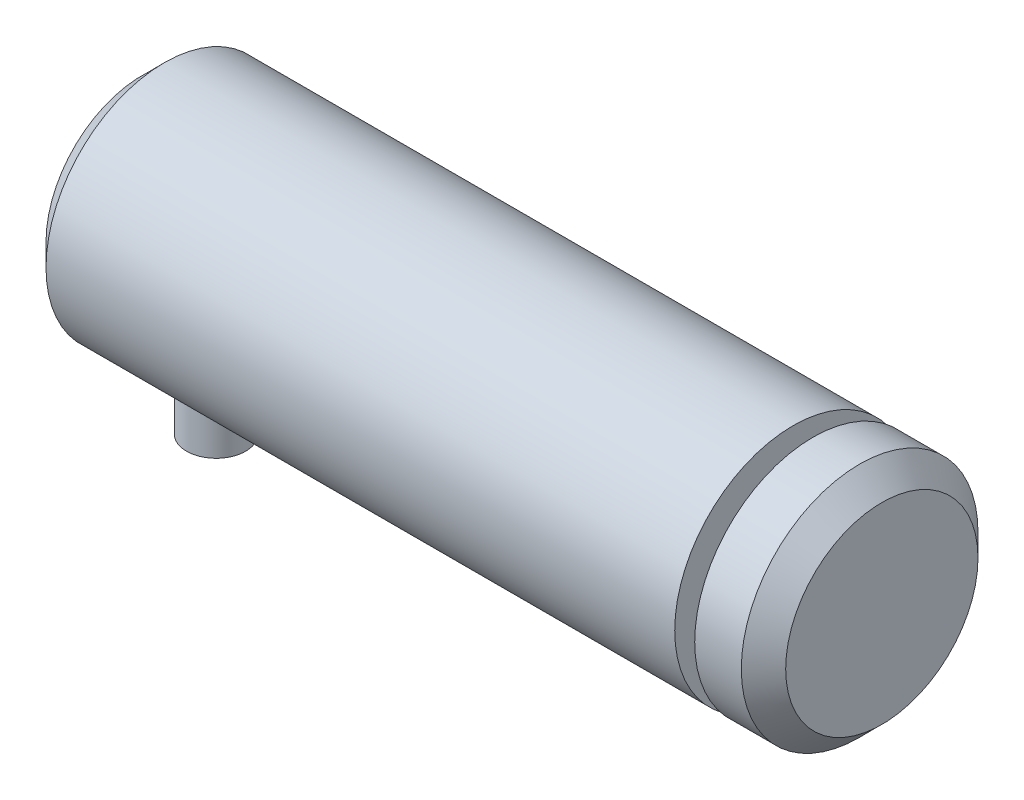
ISO-10303-21;
HEADER;
FILE_DESCRIPTION(('STEP AP214'),'2;1');
FILE_NAME('part.step','',(''),(''),'','','');
FILE_SCHEMA(('AUTOMOTIVE_DESIGN { 1 0 10303 214 1 1 1 1 }'));
ENDSEC;
DATA;
#1=APPLICATION_CONTEXT('core data for automotive mechanical design processes');
#2=APPLICATION_PROTOCOL_DEFINITION('international standard','automotive_design',2000,#1);
#3=PRODUCT_CONTEXT('',#1,'mechanical');
#4=PRODUCT('Part','Part','',(#3));
#5=PRODUCT_RELATED_PRODUCT_CATEGORY('part','',(#4));
#6=PRODUCT_DEFINITION_FORMATION('','',#4);
#7=PRODUCT_DEFINITION_CONTEXT('part definition',#1,'design');
#8=PRODUCT_DEFINITION('design','',#6,#7);
#9=PRODUCT_DEFINITION_SHAPE('','',#8);
#10=(LENGTH_UNIT() NAMED_UNIT(*) SI_UNIT(.MILLI.,.METRE.));
#11=(NAMED_UNIT(*) PLANE_ANGLE_UNIT() SI_UNIT($,.RADIAN.));
#12=(NAMED_UNIT(*) SI_UNIT($,.STERADIAN.) SOLID_ANGLE_UNIT());
#13=UNCERTAINTY_MEASURE_WITH_UNIT(LENGTH_MEASURE(1.E-05),#10,'distance_accuracy_value','');
#14=(GEOMETRIC_REPRESENTATION_CONTEXT(3) GLOBAL_UNCERTAINTY_ASSIGNED_CONTEXT((#13)) GLOBAL_UNIT_ASSIGNED_CONTEXT((#10,
#11,#12)) REPRESENTATION_CONTEXT('',''));
#15=CARTESIAN_POINT('',(0.,0.,0.));
#16=DIRECTION('',(0.,0.,1.));
#17=DIRECTION('',(1.,0.,0.));
#18=AXIS2_PLACEMENT_3D('',#15,#16,#17);
#19=CARTESIAN_POINT('',(19.,0.,0.));
#20=DIRECTION('',(-1.,0.,0.));
#21=DIRECTION('',(0.,0.,1.));
#22=AXIS2_PLACEMENT_3D('',#19,#20,#21);
#23=CYLINDRICAL_SURFACE('',#22,8.);
#24=CARTESIAN_POINT('',(20.35,0.,0.));
#25=DIRECTION('',(-1.,0.,0.));
#26=DIRECTION('',(0.,0.,1.));
#27=AXIS2_PLACEMENT_3D('',#24,#25,#26);
#28=CIRCLE('',#27,8.);
#29=CARTESIAN_POINT('',(20.35,0.,8.));
#30=VERTEX_POINT('',#29);
#31=EDGE_CURVE('E58',#30,#30,#28,.T.);
#32=ORIENTED_EDGE('',*,*,#31,.F.);
#33=EDGE_LOOP('',(#32));
#34=FACE_BOUND('',#33,.T.);
#35=CARTESIAN_POINT('',(23.5,0.,0.));
#36=DIRECTION('',(-1.,0.,0.));
#37=DIRECTION('',(0.,0.,1.));
#38=AXIS2_PLACEMENT_3D('',#35,#36,#37);
#39=CIRCLE('',#38,8.);
#40=CARTESIAN_POINT('',(23.5,0.,8.));
#41=VERTEX_POINT('',#40);
#42=EDGE_CURVE('E67',#41,#41,#39,.T.);
#43=ORIENTED_EDGE('',*,*,#42,.T.);
#44=EDGE_LOOP('',(#43));
#45=FACE_BOUND('',#44,.T.);
#46=ADVANCED_FACE('F31',(#34,#45),#23,.T.);
#47=CARTESIAN_POINT('',(-23.5,0.,0.));
#48=DIRECTION('',(-1.,0.,0.));
#49=DIRECTION('',(0.,0.,1.));
#50=AXIS2_PLACEMENT_3D('',#47,#48,#49);
#51=CIRCLE('',#50,8.);
#52=CARTESIAN_POINT('',(-23.5,0.,8.));
#53=VERTEX_POINT('',#52);
#54=EDGE_CURVE('E10',#53,#53,#51,.T.);
#55=ORIENTED_EDGE('',*,*,#54,.F.);
#56=EDGE_LOOP('',(#55));
#57=FACE_BOUND('',#56,.T.);
#58=CARTESIAN_POINT('',(-20.,-7.74596669241483,2.));
#59=CARTESIAN_POINT('',(-19.8895593992587,-7.74596880070288,1.99999686287446));
#60=CARTESIAN_POINT('',(-19.7790840810572,-7.74835444811678,1.99082099639812));
#61=CARTESIAN_POINT('',(-19.5613059374612,-7.75761489594051,1.95441850037103));
#62=CARTESIAN_POINT('',(-19.4540049964255,-7.76449230897304,1.92718136539368));
#63=CARTESIAN_POINT('',(-19.2457571694503,-7.7819097967692,1.85559295970563));
#64=CARTESIAN_POINT('',(-19.1448022756914,-7.79244514152366,1.81126378228359));
#65=CARTESIAN_POINT('',(-18.9517513179681,-7.81598553623007,1.7068169130091));
#66=CARTESIAN_POINT('',(-18.8596556303358,-7.82899069102791,1.64669855084854));
#67=CARTESIAN_POINT('',(-18.6849106837902,-7.856325730845,1.5109667418495));
#68=CARTESIAN_POINT('',(-18.60248511972,-7.87067678098427,1.43506951016324));
#69=CARTESIAN_POINT('',(-18.4513908845117,-7.89890300412235,1.27054565128053));
#70=CARTESIAN_POINT('',(-18.3827234995026,-7.91277813253111,1.18191783534424));
#71=CARTESIAN_POINT('',(-18.260179625895,-7.93872332416466,0.992916160863162));
#72=CARTESIAN_POINT('',(-18.2065228894708,-7.95076549920474,0.892395660956094));
#73=CARTESIAN_POINT('',(-18.1169522846775,-7.97144649540787,0.683410547434207));
#74=CARTESIAN_POINT('',(-18.0810357984676,-7.98008581867475,0.574947108633549));
#75=CARTESIAN_POINT('',(-18.0286817323371,-7.99283807078544,0.355487007003325));
#76=CARTESIAN_POINT('',(-18.0118642845387,-7.99703915075451,0.244586175639176));
#77=CARTESIAN_POINT('',(-17.9969932965796,-8.00074875285838,0.0214630554102116));
#78=CARTESIAN_POINT('',(-17.9989369822323,-8.00025796877363,-0.0907590356304586));
#79=CARTESIAN_POINT('',(-18.0212598802001,-7.99470475962828,-0.310704494344778));
#80=CARTESIAN_POINT('',(-18.0412290600431,-7.98974401872699,-0.418472431202137));
#81=CARTESIAN_POINT('',(-18.0983770160388,-7.97592669219883,-0.629076494827375));
#82=CARTESIAN_POINT('',(-18.1355567083019,-7.96706989918753,-0.731912358740878));
#83=CARTESIAN_POINT('',(-18.2264020565497,-7.94630007760717,-0.930813407003615));
#84=CARTESIAN_POINT('',(-18.2802136357294,-7.93436015756043,-1.02680901953301));
#85=CARTESIAN_POINT('',(-18.402684543293,-7.90871923047719,-1.20855124468098));
#86=CARTESIAN_POINT('',(-18.4713464548485,-7.89501791721992,-1.29429607017101));
#87=CARTESIAN_POINT('',(-18.6237669935859,-7.86690971015616,-1.45554807016991));
#88=CARTESIAN_POINT('',(-18.7078839138782,-7.85249375620734,-1.5307153581504));
#89=CARTESIAN_POINT('',(-18.8876799788322,-7.82492034813365,-1.66595275192604));
#90=CARTESIAN_POINT('',(-18.9833596635928,-7.81176295284776,-1.72602215209203));
#91=CARTESIAN_POINT('',(-19.1842320273192,-7.78816397465319,-1.8295762580452));
#92=CARTESIAN_POINT('',(-19.2894685842506,-7.77773586980577,-1.87297913394098));
#93=CARTESIAN_POINT('',(-19.5060683744612,-7.76094912111966,-1.94137124127268));
#94=CARTESIAN_POINT('',(-19.6174302911865,-7.75458960648175,-1.96636441310582));
#95=CARTESIAN_POINT('',(-19.8399676012185,-7.74684284831313,-1.99666371093214));
#96=CARTESIAN_POINT('',(-19.9510702346637,-7.74532871274919,-2.0024723791357));
#97=CARTESIAN_POINT('',(-20.1726575492625,-7.74709874784831,-1.99561359241244));
#98=CARTESIAN_POINT('',(-20.283142286361,-7.75038247681013,-1.98294783827904));
#99=CARTESIAN_POINT('',(-20.4984914119638,-7.76125665563648,-1.93994037115013));
#100=CARTESIAN_POINT('',(-20.6034181812567,-7.768775761875,-1.90989125462539));
#101=CARTESIAN_POINT('',(-20.8067451662813,-7.7872057461677,-1.83329446533649));
#102=CARTESIAN_POINT('',(-20.9051446072443,-7.79811702598891,-1.78674483817003));
#103=CARTESIAN_POINT('',(-21.0947530222939,-7.8223690967461,-1.67741653434924));
#104=CARTESIAN_POINT('',(-21.1857830720345,-7.83575334885313,-1.6143374030685));
#105=CARTESIAN_POINT('',(-21.3561506902411,-7.86333666457373,-1.47412058586891));
#106=CARTESIAN_POINT('',(-21.4354863333201,-7.87753586182776,-1.39698058961088));
#107=CARTESIAN_POINT('',(-21.5822488340568,-7.90557922425285,-1.22852544196945));
#108=CARTESIAN_POINT('',(-21.649328050039,-7.91940561649468,-1.13690390506318));
#109=CARTESIAN_POINT('',(-21.767148693561,-7.94477773290988,-0.943405365389347));
#110=CARTESIAN_POINT('',(-21.8178909732866,-7.95632357603169,-0.841528897915179));
#111=CARTESIAN_POINT('',(-21.9011568276223,-7.9757609259065,-0.631116403462178));
#112=CARTESIAN_POINT('',(-21.9338114275033,-7.98367864017925,-0.522634762055761));
#113=CARTESIAN_POINT('',(-21.9803682676867,-7.99508234716634,-0.301499520637611));
#114=CARTESIAN_POINT('',(-21.9942741269912,-7.99856919514738,-0.188846730082478));
#115=CARTESIAN_POINT('',(-22.0027351791511,-8.00068338817612,0.0341670528866493));
#116=CARTESIAN_POINT('',(-21.9978034181908,-7.99943957759977,0.144507653932046));
#117=CARTESIAN_POINT('',(-21.9699043454113,-7.99251792914887,0.362734992829504));
#118=CARTESIAN_POINT('',(-21.9469375699737,-7.98684022314338,0.47062180356186));
#119=CARTESIAN_POINT('',(-21.8838955604583,-7.97170865707778,0.68034207128955));
#120=CARTESIAN_POINT('',(-21.8439130933712,-7.96227529004785,0.782204989161727));
#121=CARTESIAN_POINT('',(-21.7480588419609,-7.94062577827316,0.977834106083249));
#122=CARTESIAN_POINT('',(-21.692185054659,-7.92840928277515,1.07159928253127));
#123=CARTESIAN_POINT('',(-21.5645695320077,-7.90214499360574,1.25080385684661));
#124=CARTESIAN_POINT('',(-21.4924797141923,-7.88806033883329,1.33598997659667));
#125=CARTESIAN_POINT('',(-21.3351542960453,-7.85981298114379,1.49323004054701));
#126=CARTESIAN_POINT('',(-21.2499153677777,-7.84565025934604,1.56528065015318));
#127=CARTESIAN_POINT('',(-21.0667971716211,-7.81854951691005,1.69552405294366));
#128=CARTESIAN_POINT('',(-20.9687117532695,-7.80563927346578,1.75343323883276));
#129=CARTESIAN_POINT('',(-20.7638890202504,-7.78287910989656,1.85185379317094));
#130=CARTESIAN_POINT('',(-20.6571580678123,-7.77302696466428,1.8923778195043));
#131=CARTESIAN_POINT('',(-20.4588459763297,-7.75903817501475,1.948845057142));
#132=CARTESIAN_POINT('',(-20.3682136712277,-7.75417326006998,1.96798634119376));
#133=CARTESIAN_POINT('',(-20.1850622620046,-7.7476367716524,1.99356458514354));
#134=CARTESIAN_POINT('',(-20.0925433195112,-7.74596492578215,2.0000026287435));
#135=CARTESIAN_POINT('',(-20.,-7.74596669241483,2.));
#136=B_SPLINE_CURVE_WITH_KNOTS('',3,(#58,#59,#60,#61,#62,#63,#64,#65,#66,#67,#68,#69,#70,#71,
#72,#73,#74,#75,#76,#77,#78,#79,#80,#81,#82,#83,#84,#85,#86,#87,#88,#89,#90,#91,#92,#93,#94,#95,
#96,#97,#98,#99,#100,#101,#102,#103,#104,#105,#106,#107,#108,#109,#110,#111,#112,#113,#114,#115,
#116,#117,#118,#119,#120,#121,#122,#123,#124,#125,#126,#127,#128,#129,#130,#131,#132,#133,#134,
#135),.UNSPECIFIED.,.T.,.F.,(4,2,2,2,2,2,2,2,2,2,2,2,2,2,2,2,2,2,2,2,2,2,2,2,2,2,2,2,2,2,2,2,2,
2,2,2,2,2,4),(0.,0.33098195338891,0.662156593142934,0.992904581732817,1.32366661404383,
1.66099163354381,1.99834817183893,2.34041197118336,2.68242527877674,3.01751000796277,
3.35254518932816,3.68014610151158,4.00776445379829,4.33834299403556,4.6689790837513,
5.00856373257529,5.34816424959842,5.68941145606722,6.03058560103637,6.36274859809373,
6.69488101747041,7.02157924007365,7.34831617137134,7.68146276687326,8.01466415108035,
8.35620264772255,8.69772332575642,9.03673658245543,9.3756843912723,9.70546756901965,
10.0352409390158,10.3632390124777,10.6912784459046,11.0271767726566,11.3631602525241,
11.7054118182895,12.0474137709605,12.3247826174462,12.6021278008238),.UNSPECIFIED.);
#137=CARTESIAN_POINT('',(-20.,-7.74596669241483,2.));
#138=VERTEX_POINT('',#137);
#139=EDGE_CURVE('E35',#138,#138,#136,.T.);
#140=ORIENTED_EDGE('',*,*,#139,.T.);
#141=EDGE_LOOP('',(#140));
#142=FACE_BOUND('',#141,.T.);
#143=CARTESIAN_POINT('',(19.,0.,0.));
#144=DIRECTION('',(-1.,0.,0.));
#145=DIRECTION('',(0.,0.,1.));
#146=AXIS2_PLACEMENT_3D('',#143,#144,#145);
#147=CIRCLE('',#146,8.);
#148=CARTESIAN_POINT('',(19.,0.,8.));
#149=VERTEX_POINT('',#148);
#150=EDGE_CURVE('E61',#149,#149,#147,.T.);
#151=ORIENTED_EDGE('',*,*,#150,.T.);
#152=EDGE_LOOP('',(#151));
#153=FACE_BOUND('',#152,.T.);
#154=ADVANCED_FACE('F88',(#57,#142,#153),#23,.T.);
#155=CARTESIAN_POINT('',(-25.,0.,0.));
#156=DIRECTION('',(1.,0.,0.));
#157=DIRECTION('',(0.,0.,-1.));
#158=AXIS2_PLACEMENT_3D('',#155,#156,#157);
#159=CONICAL_SURFACE('',#158,6.5,0.785398163397448);
#160=ORIENTED_EDGE('',*,*,#54,.T.);
#161=EDGE_LOOP('',(#160));
#162=FACE_BOUND('',#161,.T.);
#163=CARTESIAN_POINT('',(-25.,0.,0.));
#164=DIRECTION('',(-1.,0.,0.));
#165=DIRECTION('',(0.,0.,1.));
#166=AXIS2_PLACEMENT_3D('',#163,#164,#165);
#167=CIRCLE('',#166,6.5);
#168=CARTESIAN_POINT('',(-25.,0.,6.5));
#169=VERTEX_POINT('',#168);
#170=EDGE_CURVE('E43',#169,#169,#167,.T.);
#171=ORIENTED_EDGE('',*,*,#170,.F.);
#172=EDGE_LOOP('',(#171));
#173=FACE_BOUND('',#172,.T.);
#174=ADVANCED_FACE('F93',(#162,#173),#159,.T.);
#175=CARTESIAN_POINT('',(-25.,0.,0.));
#176=DIRECTION('',(1.,0.,0.));
#177=DIRECTION('',(0.,0.,-1.));
#178=AXIS2_PLACEMENT_3D('',#175,#176,#177);
#179=PLANE('',#178);
#180=ORIENTED_EDGE('',*,*,#170,.T.);
#181=EDGE_LOOP('',(#180));
#182=FACE_BOUND('',#181,.T.);
#183=ADVANCED_FACE('F33',(#182),#179,.F.);
#184=CARTESIAN_POINT('',(-20.,-12.,0.));
#185=DIRECTION('',(0.,1.,0.));
#186=DIRECTION('',(0.,0.,1.));
#187=AXIS2_PLACEMENT_3D('',#184,#185,#186);
#188=CYLINDRICAL_SURFACE('',#187,2.);
#189=CARTESIAN_POINT('',(-20.,-12.,0.));
#190=DIRECTION('',(0.,1.,0.));
#191=DIRECTION('',(0.,0.,1.));
#192=AXIS2_PLACEMENT_3D('',#189,#190,#191);
#193=CIRCLE('',#192,2.);
#194=CARTESIAN_POINT('',(-20.,-12.,2.));
#195=VERTEX_POINT('',#194);
#196=EDGE_CURVE('E49',#195,#195,#193,.T.);
#197=ORIENTED_EDGE('',*,*,#196,.T.);
#198=EDGE_LOOP('',(#197));
#199=FACE_BOUND('',#198,.T.);
#200=ORIENTED_EDGE('',*,*,#139,.F.);
#201=EDGE_LOOP('',(#200));
#202=FACE_BOUND('',#201,.T.);
#203=ADVANCED_FACE('F99',(#199,#202),#188,.T.);
#204=CARTESIAN_POINT('',(-20.,-12.,0.));
#205=DIRECTION('',(0.,1.,0.));
#206=DIRECTION('',(0.,0.,1.));
#207=AXIS2_PLACEMENT_3D('',#204,#205,#206);
#208=PLANE('',#207);
#209=ORIENTED_EDGE('',*,*,#196,.F.);
#210=EDGE_LOOP('',(#209));
#211=FACE_BOUND('',#210,.T.);
#212=ADVANCED_FACE('F103',(#211),#208,.F.);
#213=CARTESIAN_POINT('',(19.,8.,0.));
#214=DIRECTION('',(1.,0.,0.));
#215=DIRECTION('',(0.,0.,-1.));
#216=AXIS2_PLACEMENT_3D('',#213,#214,#215);
#217=PLANE('',#216);
#218=CARTESIAN_POINT('',(19.,0.,0.));
#219=DIRECTION('',(-1.,0.,0.));
#220=DIRECTION('',(0.,0.,1.));
#221=AXIS2_PLACEMENT_3D('',#218,#219,#220);
#222=CIRCLE('',#221,6.);
#223=CARTESIAN_POINT('',(19.,0.,6.));
#224=VERTEX_POINT('',#223);
#225=EDGE_CURVE('E52',#224,#224,#222,.T.);
#226=ORIENTED_EDGE('',*,*,#225,.T.);
#227=EDGE_LOOP('',(#226));
#228=FACE_BOUND('',#227,.T.);
#229=ORIENTED_EDGE('',*,*,#150,.F.);
#230=EDGE_LOOP('',(#229));
#231=FACE_BOUND('',#230,.T.);
#232=ADVANCED_FACE('F106',(#228,#231),#217,.T.);
#233=CARTESIAN_POINT('',(39.,0.,0.));
#234=DIRECTION('',(-1.,0.,0.));
#235=DIRECTION('',(0.,0.,1.));
#236=AXIS2_PLACEMENT_3D('',#233,#234,#235);
#237=CYLINDRICAL_SURFACE('',#236,6.);
#238=CARTESIAN_POINT('',(20.35,0.,0.));
#239=DIRECTION('',(-1.,0.,0.));
#240=DIRECTION('',(0.,0.,1.));
#241=AXIS2_PLACEMENT_3D('',#238,#239,#240);
#242=CIRCLE('',#241,6.);
#243=CARTESIAN_POINT('',(20.35,0.,6.));
#244=VERTEX_POINT('',#243);
#245=EDGE_CURVE('E55',#244,#244,#242,.T.);
#246=ORIENTED_EDGE('',*,*,#245,.T.);
#247=EDGE_LOOP('',(#246));
#248=FACE_BOUND('',#247,.T.);
#249=ORIENTED_EDGE('',*,*,#225,.F.);
#250=EDGE_LOOP('',(#249));
#251=FACE_BOUND('',#250,.T.);
#252=ADVANCED_FACE('F84',(#248,#251),#237,.T.);
#253=CARTESIAN_POINT('',(20.35,6.,0.));
#254=DIRECTION('',(-1.,0.,0.));
#255=DIRECTION('',(0.,0.,1.));
#256=AXIS2_PLACEMENT_3D('',#253,#254,#255);
#257=PLANE('',#256);
#258=ORIENTED_EDGE('',*,*,#31,.T.);
#259=EDGE_LOOP('',(#258));
#260=FACE_BOUND('',#259,.T.);
#261=ORIENTED_EDGE('',*,*,#245,.F.);
#262=EDGE_LOOP('',(#261));
#263=FACE_BOUND('',#262,.T.);
#264=ADVANCED_FACE('F75',(#260,#263),#257,.T.);
#265=CARTESIAN_POINT('',(23.5,0.,0.));
#266=DIRECTION('',(-1.,0.,0.));
#267=DIRECTION('',(0.,0.,1.));
#268=AXIS2_PLACEMENT_3D('',#265,#266,#267);
#269=CONICAL_SURFACE('',#268,8.,0.785398163397448);
#270=CARTESIAN_POINT('',(25.,0.,0.));
#271=DIRECTION('',(-1.,0.,0.));
#272=DIRECTION('',(0.,0.,1.));
#273=AXIS2_PLACEMENT_3D('',#270,#271,#272);
#274=CIRCLE('',#273,6.5);
#275=CARTESIAN_POINT('',(25.,0.,6.5));
#276=VERTEX_POINT('',#275);
#277=EDGE_CURVE('E64',#276,#276,#274,.T.);
#278=ORIENTED_EDGE('',*,*,#277,.T.);
#279=EDGE_LOOP('',(#278));
#280=FACE_BOUND('',#279,.T.);
#281=ORIENTED_EDGE('',*,*,#42,.F.);
#282=EDGE_LOOP('',(#281));
#283=FACE_BOUND('',#282,.T.);
#284=ADVANCED_FACE('F72',(#280,#283),#269,.T.);
#285=CARTESIAN_POINT('',(25.,8.,0.));
#286=DIRECTION('',(-1.,0.,0.));
#287=DIRECTION('',(0.,0.,1.));
#288=AXIS2_PLACEMENT_3D('',#285,#286,#287);
#289=PLANE('',#288);
#290=ORIENTED_EDGE('',*,*,#277,.F.);
#291=EDGE_LOOP('',(#290));
#292=FACE_BOUND('',#291,.T.);
#293=ADVANCED_FACE('F74',(#292),#289,.F.);
#294=CLOSED_SHELL('',(#46,#154,#174,#183,#203,#212,#232,#252,#264,#284,#293));
#295=MANIFOLD_SOLID_BREP('B2',#294);
#296=ADVANCED_BREP_SHAPE_REPRESENTATION('',(#18,#295),#14);
#297=SHAPE_DEFINITION_REPRESENTATION(#9,#296);
ENDSEC;
END-ISO-10303-21;
